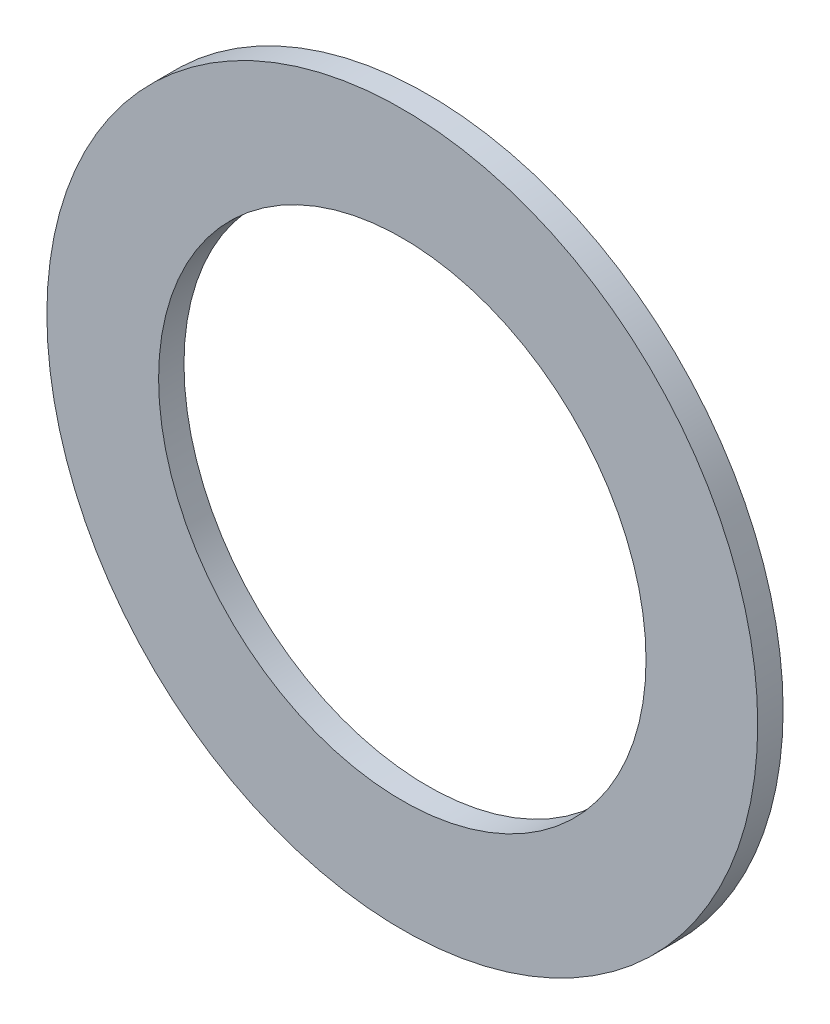
ISO-10303-21;
HEADER;
FILE_DESCRIPTION(('STEP AP214'),'2;1');
FILE_NAME('part.step','',(''),(''),'','','');
FILE_SCHEMA(('AUTOMOTIVE_DESIGN { 1 0 10303 214 1 1 1 1 }'));
ENDSEC;
DATA;
#1=APPLICATION_CONTEXT('core data for automotive mechanical design processes');
#2=APPLICATION_PROTOCOL_DEFINITION('international standard','automotive_design',2000,#1);
#3=PRODUCT_CONTEXT('',#1,'mechanical');
#4=PRODUCT('Part','Part','',(#3));
#5=PRODUCT_RELATED_PRODUCT_CATEGORY('part','',(#4));
#6=PRODUCT_DEFINITION_FORMATION('','',#4);
#7=PRODUCT_DEFINITION_CONTEXT('part definition',#1,'design');
#8=PRODUCT_DEFINITION('design','',#6,#7);
#9=PRODUCT_DEFINITION_SHAPE('','',#8);
#10=(LENGTH_UNIT() NAMED_UNIT(*) SI_UNIT(.MILLI.,.METRE.));
#11=(NAMED_UNIT(*) PLANE_ANGLE_UNIT() SI_UNIT($,.RADIAN.));
#12=(NAMED_UNIT(*) SI_UNIT($,.STERADIAN.) SOLID_ANGLE_UNIT());
#13=UNCERTAINTY_MEASURE_WITH_UNIT(LENGTH_MEASURE(1.E-05),#10,'distance_accuracy_value','');
#14=(GEOMETRIC_REPRESENTATION_CONTEXT(3) GLOBAL_UNCERTAINTY_ASSIGNED_CONTEXT((#13)) GLOBAL_UNIT_ASSIGNED_CONTEXT((#10,
#11,#12)) REPRESENTATION_CONTEXT('',''));
#15=CARTESIAN_POINT('',(0.,0.,0.));
#16=DIRECTION('',(0.,0.,1.));
#17=DIRECTION('',(1.,0.,0.));
#18=AXIS2_PLACEMENT_3D('',#15,#16,#17);
#19=CARTESIAN_POINT('',(-0.851831777820972,0.,2.5));
#20=DIRECTION('',(0.,0.,1.));
#21=DIRECTION('',(1.,0.,0.));
#22=AXIS2_PLACEMENT_3D('',#19,#20,#21);
#23=PLANE('',#22);
#24=CARTESIAN_POINT('',(-0.851831777820972,0.,2.5));
#25=DIRECTION('',(0.,0.,1.));
#26=DIRECTION('',(1.,0.,0.));
#27=AXIS2_PLACEMENT_3D('',#24,#25,#26);
#28=CIRCLE('',#27,35.);
#29=CARTESIAN_POINT('',(34.148168222179,0.,2.5));
#30=VERTEX_POINT('',#29);
#31=EDGE_CURVE('E10',#30,#30,#28,.T.);
#32=ORIENTED_EDGE('',*,*,#31,.T.);
#33=EDGE_LOOP('',(#32));
#34=FACE_BOUND('',#33,.T.);
#35=CARTESIAN_POINT('',(-0.851831777820972,0.,2.5));
#36=DIRECTION('',(0.,0.,1.));
#37=DIRECTION('',(1.,0.,0.));
#38=AXIS2_PLACEMENT_3D('',#35,#36,#37);
#39=CIRCLE('',#38,24.);
#40=CARTESIAN_POINT('',(23.148168222179,0.,2.5));
#41=VERTEX_POINT('',#40);
#42=EDGE_CURVE('E53',#41,#41,#39,.T.);
#43=ORIENTED_EDGE('',*,*,#42,.F.);
#44=EDGE_LOOP('',(#43));
#45=FACE_BOUND('',#44,.T.);
#46=ADVANCED_FACE('F40',(#34,#45),#23,.T.);
#47=CARTESIAN_POINT('',(-0.851831777820972,0.,0.));
#48=DIRECTION('',(0.,0.,1.));
#49=DIRECTION('',(1.,0.,0.));
#50=AXIS2_PLACEMENT_3D('',#47,#48,#49);
#51=PLANE('',#50);
#52=CARTESIAN_POINT('',(-0.851831777820972,0.,0.));
#53=DIRECTION('',(0.,0.,1.));
#54=DIRECTION('',(1.,0.,0.));
#55=AXIS2_PLACEMENT_3D('',#52,#53,#54);
#56=CIRCLE('',#55,35.);
#57=CARTESIAN_POINT('',(34.148168222179,0.,0.));
#58=VERTEX_POINT('',#57);
#59=EDGE_CURVE('E44',#58,#58,#56,.T.);
#60=ORIENTED_EDGE('',*,*,#59,.F.);
#61=EDGE_LOOP('',(#60));
#62=FACE_BOUND('',#61,.T.);
#63=CARTESIAN_POINT('',(-0.851831777820972,0.,0.));
#64=DIRECTION('',(0.,0.,1.));
#65=DIRECTION('',(1.,0.,0.));
#66=AXIS2_PLACEMENT_3D('',#63,#64,#65);
#67=CIRCLE('',#66,24.);
#68=CARTESIAN_POINT('',(23.148168222179,0.,0.));
#69=VERTEX_POINT('',#68);
#70=EDGE_CURVE('E55',#69,#69,#67,.T.);
#71=ORIENTED_EDGE('',*,*,#70,.T.);
#72=EDGE_LOOP('',(#71));
#73=FACE_BOUND('',#72,.T.);
#74=ADVANCED_FACE('F67',(#62,#73),#51,.F.);
#75=CARTESIAN_POINT('',(-0.851831777820972,0.,2.5));
#76=DIRECTION('',(0.,0.,-1.));
#77=DIRECTION('',(-1.,0.,0.));
#78=AXIS2_PLACEMENT_3D('',#75,#76,#77);
#79=CYLINDRICAL_SURFACE('',#78,35.);
#80=ORIENTED_EDGE('',*,*,#31,.F.);
#81=EDGE_LOOP('',(#80));
#82=FACE_BOUND('',#81,.T.);
#83=ORIENTED_EDGE('',*,*,#59,.T.);
#84=EDGE_LOOP('',(#83));
#85=FACE_BOUND('',#84,.T.);
#86=ADVANCED_FACE('F42',(#82,#85),#79,.T.);
#87=CARTESIAN_POINT('',(-0.851831777820972,0.,2.5));
#88=DIRECTION('',(0.,0.,-1.));
#89=DIRECTION('',(-1.,0.,0.));
#90=AXIS2_PLACEMENT_3D('',#87,#88,#89);
#91=CYLINDRICAL_SURFACE('',#90,24.);
#92=ORIENTED_EDGE('',*,*,#42,.T.);
#93=EDGE_LOOP('',(#92));
#94=FACE_BOUND('',#93,.T.);
#95=ORIENTED_EDGE('',*,*,#70,.F.);
#96=EDGE_LOOP('',(#95));
#97=FACE_BOUND('',#96,.T.);
#98=ADVANCED_FACE('F63',(#94,#97),#91,.F.);
#99=CLOSED_SHELL('',(#46,#74,#86,#98));
#100=MANIFOLD_SOLID_BREP('B2',#99);
#101=ADVANCED_BREP_SHAPE_REPRESENTATION('',(#18,#100),#14);
#102=SHAPE_DEFINITION_REPRESENTATION(#9,#101);
ENDSEC;
END-ISO-10303-21;
